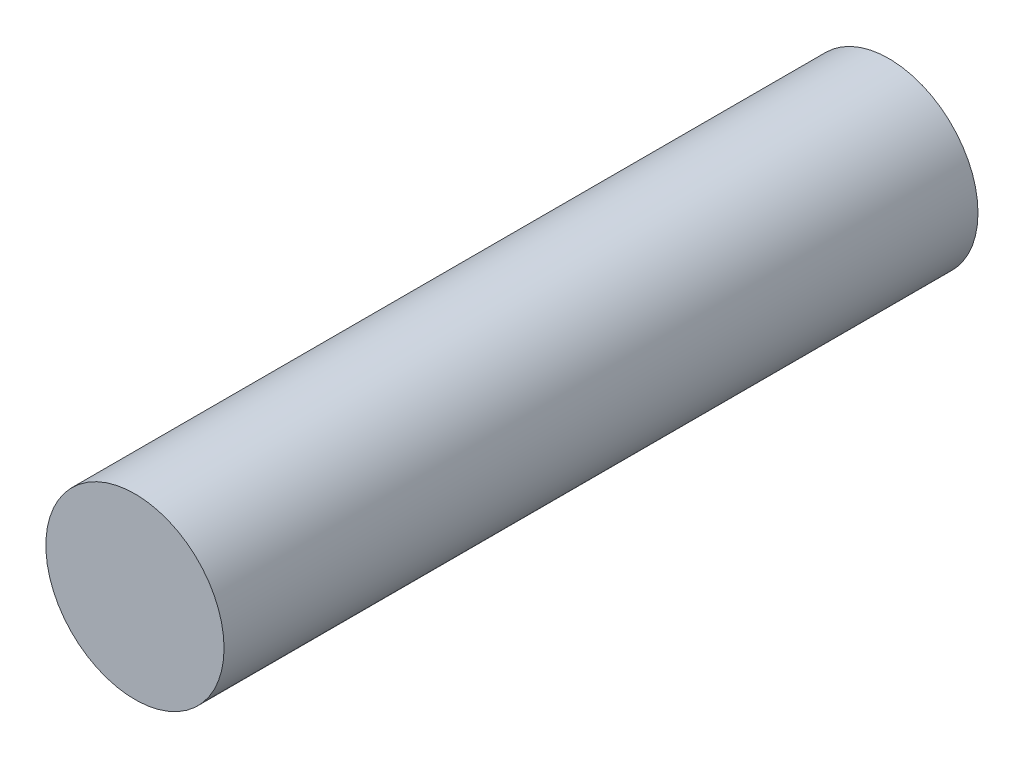
ISO-10303-21;
HEADER;
FILE_DESCRIPTION(('STEP AP214'),'2;1');
FILE_NAME('part.step','',(''),(''),'','','');
FILE_SCHEMA(('AUTOMOTIVE_DESIGN { 1 0 10303 214 1 1 1 1 }'));
ENDSEC;
DATA;
#1=APPLICATION_CONTEXT('core data for automotive mechanical design processes');
#2=APPLICATION_PROTOCOL_DEFINITION('international standard','automotive_design',2000,#1);
#3=PRODUCT_CONTEXT('',#1,'mechanical');
#4=PRODUCT('Part','Part','',(#3));
#5=PRODUCT_RELATED_PRODUCT_CATEGORY('part','',(#4));
#6=PRODUCT_DEFINITION_FORMATION('','',#4);
#7=PRODUCT_DEFINITION_CONTEXT('part definition',#1,'design');
#8=PRODUCT_DEFINITION('design','',#6,#7);
#9=PRODUCT_DEFINITION_SHAPE('','',#8);
#10=(LENGTH_UNIT() NAMED_UNIT(*) SI_UNIT(.MILLI.,.METRE.));
#11=(NAMED_UNIT(*) PLANE_ANGLE_UNIT() SI_UNIT($,.RADIAN.));
#12=(NAMED_UNIT(*) SI_UNIT($,.STERADIAN.) SOLID_ANGLE_UNIT());
#13=UNCERTAINTY_MEASURE_WITH_UNIT(LENGTH_MEASURE(1.E-05),#10,'distance_accuracy_value','');
#14=(GEOMETRIC_REPRESENTATION_CONTEXT(3) GLOBAL_UNCERTAINTY_ASSIGNED_CONTEXT((#13)) GLOBAL_UNIT_ASSIGNED_CONTEXT((#10,
#11,#12)) REPRESENTATION_CONTEXT('',''));
#15=CARTESIAN_POINT('',(0.,0.,0.));
#16=DIRECTION('',(0.,0.,1.));
#17=DIRECTION('',(1.,0.,0.));
#18=AXIS2_PLACEMENT_3D('',#15,#16,#17);
#19=CARTESIAN_POINT('',(0.,0.,5.5));
#20=DIRECTION('',(0.,0.,-1.));
#21=DIRECTION('',(-1.,0.,0.));
#22=AXIS2_PLACEMENT_3D('',#19,#20,#21);
#23=CYLINDRICAL_SURFACE('',#22,1.3);
#24=CARTESIAN_POINT('',(0.,0.,5.5));
#25=DIRECTION('',(0.,0.,1.));
#26=DIRECTION('',(1.,0.,0.));
#27=AXIS2_PLACEMENT_3D('',#24,#25,#26);
#28=CIRCLE('',#27,1.3);
#29=CARTESIAN_POINT('',(1.3,0.,5.5));
#30=VERTEX_POINT('',#29);
#31=EDGE_CURVE('E10',#30,#30,#28,.T.);
#32=ORIENTED_EDGE('',*,*,#31,.F.);
#33=EDGE_LOOP('',(#32));
#34=FACE_BOUND('',#33,.T.);
#35=CARTESIAN_POINT('',(0.,0.,-5.5));
#36=DIRECTION('',(0.,0.,1.));
#37=DIRECTION('',(1.,0.,0.));
#38=AXIS2_PLACEMENT_3D('',#35,#36,#37);
#39=CIRCLE('',#38,1.3);
#40=CARTESIAN_POINT('',(1.3,0.,-5.5));
#41=VERTEX_POINT('',#40);
#42=EDGE_CURVE('E40',#41,#41,#39,.T.);
#43=ORIENTED_EDGE('',*,*,#42,.T.);
#44=EDGE_LOOP('',(#43));
#45=FACE_BOUND('',#44,.T.);
#46=ADVANCED_FACE('F37',(#34,#45),#23,.T.);
#47=CARTESIAN_POINT('',(0.,0.,5.5));
#48=DIRECTION('',(0.,0.,1.));
#49=DIRECTION('',(1.,0.,0.));
#50=AXIS2_PLACEMENT_3D('',#47,#48,#49);
#51=PLANE('',#50);
#52=ORIENTED_EDGE('',*,*,#31,.T.);
#53=EDGE_LOOP('',(#52));
#54=FACE_BOUND('',#53,.T.);
#55=ADVANCED_FACE('F54',(#54),#51,.T.);
#56=CARTESIAN_POINT('',(0.,0.,-5.5));
#57=DIRECTION('',(0.,0.,1.));
#58=DIRECTION('',(1.,0.,0.));
#59=AXIS2_PLACEMENT_3D('',#56,#57,#58);
#60=PLANE('',#59);
#61=ORIENTED_EDGE('',*,*,#42,.F.);
#62=EDGE_LOOP('',(#61));
#63=FACE_BOUND('',#62,.T.);
#64=ADVANCED_FACE('F52',(#63),#60,.F.);
#65=CLOSED_SHELL('',(#46,#55,#64));
#66=MANIFOLD_SOLID_BREP('B2',#65);
#67=ADVANCED_BREP_SHAPE_REPRESENTATION('',(#18,#66),#14);
#68=SHAPE_DEFINITION_REPRESENTATION(#9,#67);
ENDSEC;
END-ISO-10303-21;
